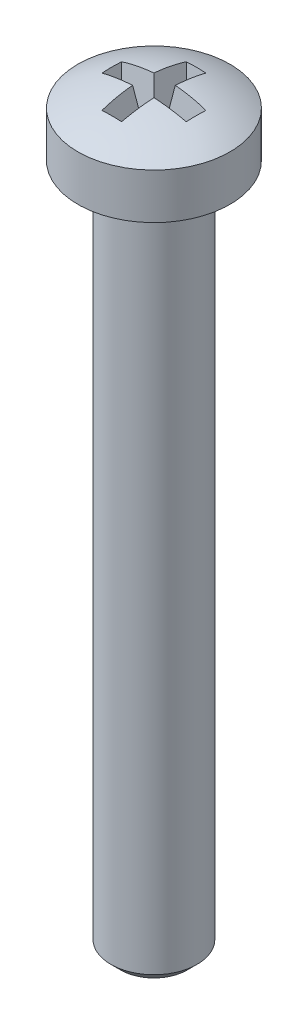
ISO-10303-21;
HEADER;
FILE_DESCRIPTION(('STEP AP214'),'2;1');
FILE_NAME('part.step','',(''),(''),'','','');
FILE_SCHEMA(('AUTOMOTIVE_DESIGN { 1 0 10303 214 1 1 1 1 }'));
ENDSEC;
DATA;
#1=APPLICATION_CONTEXT('core data for automotive mechanical design processes');
#2=APPLICATION_PROTOCOL_DEFINITION('international standard','automotive_design',2000,#1);
#3=PRODUCT_CONTEXT('',#1,'mechanical');
#4=PRODUCT('Part','Part','',(#3));
#5=PRODUCT_RELATED_PRODUCT_CATEGORY('part','',(#4));
#6=PRODUCT_DEFINITION_FORMATION('','',#4);
#7=PRODUCT_DEFINITION_CONTEXT('part definition',#1,'design');
#8=PRODUCT_DEFINITION('design','',#6,#7);
#9=PRODUCT_DEFINITION_SHAPE('','',#8);
#10=(LENGTH_UNIT() NAMED_UNIT(*) SI_UNIT(.MILLI.,.METRE.));
#11=(NAMED_UNIT(*) PLANE_ANGLE_UNIT() SI_UNIT($,.RADIAN.));
#12=(NAMED_UNIT(*) SI_UNIT($,.STERADIAN.) SOLID_ANGLE_UNIT());
#13=UNCERTAINTY_MEASURE_WITH_UNIT(LENGTH_MEASURE(1.E-05),#10,'distance_accuracy_value','');
#14=(GEOMETRIC_REPRESENTATION_CONTEXT(3) GLOBAL_UNCERTAINTY_ASSIGNED_CONTEXT((#13)) GLOBAL_UNIT_ASSIGNED_CONTEXT((#10,
#11,#12)) REPRESENTATION_CONTEXT('',''));
#15=CARTESIAN_POINT('',(0.,0.,0.));
#16=DIRECTION('',(0.,0.,1.));
#17=DIRECTION('',(1.,0.,0.));
#18=AXIS2_PLACEMENT_3D('',#15,#16,#17);
#19=CARTESIAN_POINT('',(6.,9.8,3.3));
#20=DIRECTION('',(0.,1.,0.));
#21=DIRECTION('',(0.,0.,1.));
#22=AXIS2_PLACEMENT_3D('',#19,#20,#21);
#23=SPHERICAL_SURFACE('',#22,3.);
#24=CARTESIAN_POINT('',(6.,12.3980762113533,3.3));
#25=DIRECTION('',(0.,1.,0.));
#26=DIRECTION('',(-1.,0.,0.));
#27=AXIS2_PLACEMENT_3D('',#24,#25,#26);
#28=CIRCLE('',#27,1.5);
#29=CARTESIAN_POINT('',(4.5,12.3980762113533,3.3));
#30=VERTEX_POINT('',#29);
#31=EDGE_CURVE('E161',#30,#30,#28,.T.);
#32=ORIENTED_EDGE('',*,*,#31,.T.);
#33=EDGE_LOOP('',(#32));
#34=FACE_BOUND('',#33,.T.);
#35=CARTESIAN_POINT('',(6.,9.74139917848052,2.91226230211363));
#36=DIRECTION('',(0.,-0.149438132473599,-0.988771077936042));
#37=DIRECTION('',(0.,0.988771077936042,-0.149438132473599));
#38=AXIS2_PLACEMENT_3D('',#35,#36,#37);
#39=CIRCLE('',#38,2.97426048310416);
#40=CARTESIAN_POINT('',(6.19376146307784,12.6760147557736,2.46873853692217));
#41=VERTEX_POINT('',#40);
#42=CARTESIAN_POINT('',(5.80623853692217,12.6760147557736,2.46873853692217));
#43=VERTEX_POINT('',#42);
#44=EDGE_CURVE('E11',#41,#43,#39,.F.);
#45=ORIENTED_EDGE('',*,*,#44,.F.);
#46=CARTESIAN_POINT('',(5.76447419197759,9.83559624435383,3.3));
#47=DIRECTION('',(0.988771077936042,-0.149438132473599,0.));
#48=DIRECTION('',(0.149438132473599,0.988771077936042,0.));
#49=AXIS2_PLACEMENT_3D('',#46,#47,#48);
#50=CIRCLE('',#49,2.99052846519529);
#51=CARTESIAN_POINT('',(6.21026715799329,12.7852261965451,3.08973284200672));
#52=VERTEX_POINT('',#51);
#53=EDGE_CURVE('E25',#52,#41,#50,.F.);
#54=ORIENTED_EDGE('',*,*,#53,.F.);
#55=CARTESIAN_POINT('',(6.,9.83559624435383,3.53552580802242));
#56=DIRECTION('',(0.,-0.149438132473599,-0.988771077936042));
#57=DIRECTION('',(0.,0.988771077936042,-0.149438132473599));
#58=AXIS2_PLACEMENT_3D('',#55,#56,#57);
#59=CIRCLE('',#58,2.99052846519529);
#60=CARTESIAN_POINT('',(6.83126146307784,12.6760147557736,3.10623853692217));
#61=VERTEX_POINT('',#60);
#62=EDGE_CURVE('E213',#61,#52,#59,.F.);
#63=ORIENTED_EDGE('',*,*,#62,.F.);
#64=CARTESIAN_POINT('',(6.38773769788638,9.74139917848052,3.3));
#65=DIRECTION('',(0.988771077936042,-0.149438132473599,0.));
#66=DIRECTION('',(0.149438132473599,0.988771077936042,0.));
#67=AXIS2_PLACEMENT_3D('',#64,#65,#66);
#68=CIRCLE('',#67,2.97426048310416);
#69=CARTESIAN_POINT('',(6.83126146307784,12.6760147557736,3.49376146307783));
#70=VERTEX_POINT('',#69);
#71=EDGE_CURVE('E210',#70,#61,#68,.F.);
#72=ORIENTED_EDGE('',*,*,#71,.F.);
#73=CARTESIAN_POINT('',(6.,9.83559624435383,3.06447419197759));
#74=DIRECTION('',(0.,-0.149438132473599,0.988771077936042));
#75=DIRECTION('',(0.,-0.988771077936042,-0.149438132473599));
#76=AXIS2_PLACEMENT_3D('',#73,#74,#75);
#77=CIRCLE('',#76,2.99052846519529);
#78=CARTESIAN_POINT('',(6.21026715799329,12.7852261965451,3.51026715799328));
#79=VERTEX_POINT('',#78);
#80=EDGE_CURVE('E207',#79,#70,#77,.F.);
#81=ORIENTED_EDGE('',*,*,#80,.F.);
#82=CARTESIAN_POINT('',(5.76447419197759,9.83559624435383,3.3));
#83=DIRECTION('',(0.988771077936042,-0.149438132473599,0.));
#84=DIRECTION('',(0.149438132473599,0.988771077936042,0.));
#85=AXIS2_PLACEMENT_3D('',#82,#83,#84);
#86=CIRCLE('',#85,2.99052846519529);
#87=CARTESIAN_POINT('',(6.19376146307784,12.6760147557736,4.13126146307783));
#88=VERTEX_POINT('',#87);
#89=EDGE_CURVE('E204',#88,#79,#86,.F.);
#90=ORIENTED_EDGE('',*,*,#89,.F.);
#91=CARTESIAN_POINT('',(6.,9.74139917848052,3.68773769788637));
#92=DIRECTION('',(0.,-0.149438132473599,0.988771077936042));
#93=DIRECTION('',(0.,-0.988771077936042,-0.149438132473599));
#94=AXIS2_PLACEMENT_3D('',#91,#92,#93);
#95=CIRCLE('',#94,2.97426048310416);
#96=CARTESIAN_POINT('',(5.80623853692217,12.6760147557736,4.13126146307783));
#97=VERTEX_POINT('',#96);
#98=EDGE_CURVE('E201',#97,#88,#95,.F.);
#99=ORIENTED_EDGE('',*,*,#98,.F.);
#100=CARTESIAN_POINT('',(6.23552580802241,9.83559624435383,3.3));
#101=DIRECTION('',(-0.988771077936042,-0.149438132473599,0.));
#102=DIRECTION('',(0.149438132473599,-0.988771077936042,0.));
#103=AXIS2_PLACEMENT_3D('',#100,#101,#102);
#104=CIRCLE('',#103,2.99052846519529);
#105=CARTESIAN_POINT('',(5.78973284200671,12.7852261965451,3.51026715799328));
#106=VERTEX_POINT('',#105);
#107=EDGE_CURVE('E198',#106,#97,#104,.F.);
#108=ORIENTED_EDGE('',*,*,#107,.F.);
#109=CARTESIAN_POINT('',(6.,9.83559624435383,3.06447419197759));
#110=DIRECTION('',(0.,-0.149438132473599,0.988771077936042));
#111=DIRECTION('',(0.,-0.988771077936042,-0.149438132473599));
#112=AXIS2_PLACEMENT_3D('',#109,#110,#111);
#113=CIRCLE('',#112,2.99052846519529);
#114=CARTESIAN_POINT('',(5.16873853692217,12.6760147557736,3.49376146307783));
#115=VERTEX_POINT('',#114);
#116=EDGE_CURVE('E195',#115,#106,#113,.F.);
#117=ORIENTED_EDGE('',*,*,#116,.F.);
#118=CARTESIAN_POINT('',(5.61226230211363,9.74139917848052,3.3));
#119=DIRECTION('',(-0.988771077936042,-0.149438132473599,0.));
#120=DIRECTION('',(0.149438132473599,-0.988771077936042,0.));
#121=AXIS2_PLACEMENT_3D('',#118,#119,#120);
#122=CIRCLE('',#121,2.97426048310416);
#123=CARTESIAN_POINT('',(5.16873853692217,12.6760147557736,3.10623853692217));
#124=VERTEX_POINT('',#123);
#125=EDGE_CURVE('E192',#124,#115,#122,.F.);
#126=ORIENTED_EDGE('',*,*,#125,.F.);
#127=CARTESIAN_POINT('',(6.,9.83559624435383,3.53552580802242));
#128=DIRECTION('',(0.,-0.149438132473599,-0.988771077936042));
#129=DIRECTION('',(0.,0.988771077936042,-0.149438132473599));
#130=AXIS2_PLACEMENT_3D('',#127,#128,#129);
#131=CIRCLE('',#130,2.99052846519529);
#132=CARTESIAN_POINT('',(5.78973284200671,12.7852261965451,3.08973284200672));
#133=VERTEX_POINT('',#132);
#134=EDGE_CURVE('E189',#133,#124,#131,.F.);
#135=ORIENTED_EDGE('',*,*,#134,.F.);
#136=CARTESIAN_POINT('',(6.23552580802242,9.83559624435383,3.3));
#137=DIRECTION('',(-0.988771077936042,-0.149438132473599,0.));
#138=DIRECTION('',(0.149438132473599,-0.988771077936042,0.));
#139=AXIS2_PLACEMENT_3D('',#136,#137,#138);
#140=CIRCLE('',#139,2.99052846519529);
#141=EDGE_CURVE('E186',#43,#133,#140,.F.);
#142=ORIENTED_EDGE('',*,*,#141,.F.);
#143=EDGE_LOOP('',(#45,#54,#63,#72,#81,#90,#99,#108,#117,#126,#135,#142));
#144=FACE_BOUND('',#143,.T.);
#145=ADVANCED_FACE('F16',(#34,#144),#23,.T.);
#146=CARTESIAN_POINT('',(6.,-2.,3.3));
#147=DIRECTION('',(0.,1.,0.));
#148=DIRECTION('',(-1.,0.,0.));
#149=AXIS2_PLACEMENT_3D('',#146,#147,#148);
#150=PLANE('',#149);
#151=CARTESIAN_POINT('',(6.,-2.,3.3));
#152=DIRECTION('',(0.,1.,0.));
#153=DIRECTION('',(-1.,0.,0.));
#154=AXIS2_PLACEMENT_3D('',#151,#152,#153);
#155=CIRCLE('',#154,0.6605625);
#156=CARTESIAN_POINT('',(5.3394375,-2.,3.3));
#157=VERTEX_POINT('',#156);
#158=EDGE_CURVE('E182',#157,#157,#155,.T.);
#159=ORIENTED_EDGE('',*,*,#158,.F.);
#160=EDGE_LOOP('',(#159));
#161=FACE_BOUND('',#160,.T.);
#162=ADVANCED_FACE('F18',(#161),#150,.F.);
#163=CARTESIAN_POINT('',(6.,-2.,3.3));
#164=DIRECTION('',(0.,1.,0.));
#165=DIRECTION('',(-1.,0.,0.));
#166=AXIS2_PLACEMENT_3D('',#163,#164,#165);
#167=CONICAL_SURFACE('',#166,0.6605625,0.785398163397448);
#168=CARTESIAN_POINT('',(6.,-1.8105625,3.3));
#169=DIRECTION('',(0.,1.,0.));
#170=DIRECTION('',(-1.,0.,0.));
#171=AXIS2_PLACEMENT_3D('',#168,#169,#170);
#172=CIRCLE('',#171,0.85);
#173=CARTESIAN_POINT('',(5.15,-1.8105625,3.3));
#174=VERTEX_POINT('',#173);
#175=EDGE_CURVE('E178',#174,#174,#172,.T.);
#176=ORIENTED_EDGE('',*,*,#175,.F.);
#177=EDGE_LOOP('',(#176));
#178=FACE_BOUND('',#177,.T.);
#179=ORIENTED_EDGE('',*,*,#158,.T.);
#180=EDGE_LOOP('',(#179));
#181=FACE_BOUND('',#180,.T.);
#182=ADVANCED_FACE('F397',(#178,#181),#167,.T.);
#183=CARTESIAN_POINT('',(6.,12.8,3.3));
#184=DIRECTION('',(0.,1.,0.));
#185=DIRECTION('',(-1.,0.,0.));
#186=AXIS2_PLACEMENT_3D('',#183,#184,#185);
#187=CYLINDRICAL_SURFACE('',#186,0.85);
#188=CARTESIAN_POINT('',(6.,11.4,3.3));
#189=DIRECTION('',(0.,1.,0.));
#190=DIRECTION('',(-1.,0.,0.));
#191=AXIS2_PLACEMENT_3D('',#188,#189,#190);
#192=CIRCLE('',#191,0.85);
#193=CARTESIAN_POINT('',(5.15,11.4,3.3));
#194=VERTEX_POINT('',#193);
#195=EDGE_CURVE('E174',#194,#194,#192,.T.);
#196=ORIENTED_EDGE('',*,*,#195,.F.);
#197=EDGE_LOOP('',(#196));
#198=FACE_BOUND('',#197,.T.);
#199=ORIENTED_EDGE('',*,*,#175,.T.);
#200=EDGE_LOOP('',(#199));
#201=FACE_BOUND('',#200,.T.);
#202=ADVANCED_FACE('F387',(#198,#201),#187,.T.);
#203=CARTESIAN_POINT('',(6.,11.4,3.3));
#204=DIRECTION('',(0.,1.,0.));
#205=DIRECTION('',(-1.,0.,0.));
#206=AXIS2_PLACEMENT_3D('',#203,#204,#205);
#207=TOROIDAL_SURFACE('',#206,0.95,0.1);
#208=ORIENTED_EDGE('',*,*,#195,.T.);
#209=EDGE_LOOP('',(#208));
#210=FACE_BOUND('',#209,.T.);
#211=CARTESIAN_POINT('',(6.,11.5,3.3));
#212=DIRECTION('',(0.,1.,0.));
#213=DIRECTION('',(-1.,0.,0.));
#214=AXIS2_PLACEMENT_3D('',#211,#212,#213);
#215=CIRCLE('',#214,0.95);
#216=CARTESIAN_POINT('',(5.05,11.5,3.3));
#217=VERTEX_POINT('',#216);
#218=EDGE_CURVE('E170',#217,#217,#215,.T.);
#219=ORIENTED_EDGE('',*,*,#218,.F.);
#220=EDGE_LOOP('',(#219));
#221=FACE_BOUND('',#220,.T.);
#222=ADVANCED_FACE('F377',(#210,#221),#207,.F.);
#223=CARTESIAN_POINT('',(6.,11.5,4.25));
#224=DIRECTION('',(0.,1.,0.));
#225=DIRECTION('',(-1.,0.,0.));
#226=AXIS2_PLACEMENT_3D('',#223,#224,#225);
#227=PLANE('',#226);
#228=CARTESIAN_POINT('',(6.,11.5,3.3));
#229=DIRECTION('',(0.,1.,0.));
#230=DIRECTION('',(-1.,0.,0.));
#231=AXIS2_PLACEMENT_3D('',#228,#229,#230);
#232=CIRCLE('',#231,1.5);
#233=CARTESIAN_POINT('',(4.5,11.5,3.3));
#234=VERTEX_POINT('',#233);
#235=EDGE_CURVE('E165',#234,#234,#232,.T.);
#236=ORIENTED_EDGE('',*,*,#235,.F.);
#237=EDGE_LOOP('',(#236));
#238=FACE_BOUND('',#237,.T.);
#239=ORIENTED_EDGE('',*,*,#218,.T.);
#240=EDGE_LOOP('',(#239));
#241=FACE_BOUND('',#240,.T.);
#242=ADVANCED_FACE('F367',(#238,#241),#227,.F.);
#243=CARTESIAN_POINT('',(6.,12.8,3.3));
#244=DIRECTION('',(0.,1.,0.));
#245=DIRECTION('',(-1.,0.,0.));
#246=AXIS2_PLACEMENT_3D('',#243,#244,#245);
#247=CYLINDRICAL_SURFACE('',#246,1.5);
#248=ORIENTED_EDGE('',*,*,#31,.F.);
#249=EDGE_LOOP('',(#248));
#250=FACE_BOUND('',#249,.T.);
#251=ORIENTED_EDGE('',*,*,#235,.T.);
#252=EDGE_LOOP('',(#251));
#253=FACE_BOUND('',#252,.T.);
#254=ADVANCED_FACE('F358',(#250,#253),#247,.T.);
#255=CARTESIAN_POINT('',(5.7875,12.8,2.45));
#256=DIRECTION('',(0.,-0.149438132473599,-0.988771077936042));
#257=DIRECTION('',(0.,0.988771077936042,-0.149438132473599));
#258=AXIS2_PLACEMENT_3D('',#255,#256,#257);
#259=PLANE('',#258);
#260=ORIENTED_EDGE('',*,*,#44,.T.);
#261=DIRECTION('',(-0.14779696163853,0.977912120929502,-0.14779696163853));
#262=VECTOR('',#261,1.);
#263=CARTESIAN_POINT('',(5.7875,12.8,2.45));
#264=LINE('',#263,#262);
#265=CARTESIAN_POINT('',(5.98397578347579,11.5,2.64647578347579));
#266=VERTEX_POINT('',#265);
#267=EDGE_CURVE('E32',#266,#43,#264,.T.);
#268=ORIENTED_EDGE('',*,*,#267,.F.);
#269=DIRECTION('',(-1.,0.,0.));
#270=VECTOR('',#269,1.);
#271=CARTESIAN_POINT('',(5.7875,11.5,2.64647578347579));
#272=LINE('',#271,#270);
#273=CARTESIAN_POINT('',(6.01602421652422,11.5,2.64647578347579));
#274=VERTEX_POINT('',#273);
#275=EDGE_CURVE('E118',#266,#274,#272,.F.);
#276=ORIENTED_EDGE('',*,*,#275,.T.);
#277=DIRECTION('',(0.14779696163853,0.977912120929502,-0.14779696163853));
#278=VECTOR('',#277,1.);
#279=CARTESIAN_POINT('',(6.2125,12.8,2.45));
#280=LINE('',#279,#278);
#281=EDGE_CURVE('E166',#274,#41,#280,.T.);
#282=ORIENTED_EDGE('',*,*,#281,.T.);
#283=EDGE_LOOP('',(#260,#268,#276,#282));
#284=FACE_BOUND('',#283,.T.);
#285=ADVANCED_FACE('F117',(#284),#259,.F.);
#286=CARTESIAN_POINT('',(6.2125,12.8,2.45));
#287=DIRECTION('',(0.988771077936042,-0.149438132473599,0.));
#288=DIRECTION('',(0.149438132473599,0.988771077936042,0.));
#289=AXIS2_PLACEMENT_3D('',#286,#287,#288);
#290=PLANE('',#289);
#291=ORIENTED_EDGE('',*,*,#53,.T.);
#292=ORIENTED_EDGE('',*,*,#281,.F.);
#293=DIRECTION('',(0.,0.,-1.));
#294=VECTOR('',#293,1.);
#295=CARTESIAN_POINT('',(6.01602421652422,11.5,2.45));
#296=LINE('',#295,#294);
#297=CARTESIAN_POINT('',(6.01602421652422,11.5,3.28397578347579));
#298=VERTEX_POINT('',#297);
#299=EDGE_CURVE('E125',#274,#298,#296,.F.);
#300=ORIENTED_EDGE('',*,*,#299,.T.);
#301=DIRECTION('',(0.14779696163853,0.977912120929502,-0.14779696163853));
#302=VECTOR('',#301,1.);
#303=CARTESIAN_POINT('',(6.22642551294186,12.8921394306421,3.07357448705815));
#304=LINE('',#303,#302);
#305=EDGE_CURVE('E516',#298,#52,#304,.T.);
#306=ORIENTED_EDGE('',*,*,#305,.T.);
#307=EDGE_LOOP('',(#291,#292,#300,#306));
#308=FACE_BOUND('',#307,.T.);
#309=ADVANCED_FACE('F340',(#308),#290,.F.);
#310=CARTESIAN_POINT('',(6.2125,12.8,3.0875));
#311=DIRECTION('',(0.,-0.149438132473599,-0.988771077936042));
#312=DIRECTION('',(0.,0.988771077936042,-0.149438132473599));
#313=AXIS2_PLACEMENT_3D('',#310,#311,#312);
#314=PLANE('',#313);
#315=ORIENTED_EDGE('',*,*,#62,.T.);
#316=ORIENTED_EDGE('',*,*,#305,.F.);
#317=DIRECTION('',(-1.,0.,0.));
#318=VECTOR('',#317,1.);
#319=CARTESIAN_POINT('',(6.2125,11.5,3.28397578347579));
#320=LINE('',#319,#318);
#321=CARTESIAN_POINT('',(6.65352421652422,11.5,3.28397578347579));
#322=VERTEX_POINT('',#321);
#323=EDGE_CURVE('E132',#298,#322,#320,.F.);
#324=ORIENTED_EDGE('',*,*,#323,.T.);
#325=DIRECTION('',(0.14779696163853,0.977912120929502,-0.14779696163853));
#326=VECTOR('',#325,1.);
#327=CARTESIAN_POINT('',(6.85,12.8,3.0875));
#328=LINE('',#327,#326);
#329=EDGE_CURVE('E512',#322,#61,#328,.T.);
#330=ORIENTED_EDGE('',*,*,#329,.T.);
#331=EDGE_LOOP('',(#315,#316,#324,#330));
#332=FACE_BOUND('',#331,.T.);
#333=ADVANCED_FACE('F330',(#332),#314,.F.);
#334=CARTESIAN_POINT('',(6.85,12.8,3.0875));
#335=DIRECTION('',(0.988771077936042,-0.149438132473599,0.));
#336=DIRECTION('',(0.149438132473599,0.988771077936042,0.));
#337=AXIS2_PLACEMENT_3D('',#334,#335,#336);
#338=PLANE('',#337);
#339=ORIENTED_EDGE('',*,*,#71,.T.);
#340=ORIENTED_EDGE('',*,*,#329,.F.);
#341=DIRECTION('',(0.,0.,-1.));
#342=VECTOR('',#341,1.);
#343=CARTESIAN_POINT('',(6.65352421652422,11.5,3.0875));
#344=LINE('',#343,#342);
#345=CARTESIAN_POINT('',(6.65352421652422,11.5,3.31602421652422));
#346=VERTEX_POINT('',#345);
#347=EDGE_CURVE('E138',#322,#346,#344,.F.);
#348=ORIENTED_EDGE('',*,*,#347,.T.);
#349=DIRECTION('',(0.14779696163853,0.977912120929502,0.14779696163853));
#350=VECTOR('',#349,1.);
#351=CARTESIAN_POINT('',(6.85,12.8,3.5125));
#352=LINE('',#351,#350);
#353=EDGE_CURVE('E508',#346,#70,#352,.T.);
#354=ORIENTED_EDGE('',*,*,#353,.T.);
#355=EDGE_LOOP('',(#339,#340,#348,#354));
#356=FACE_BOUND('',#355,.T.);
#357=ADVANCED_FACE('F320',(#356),#338,.F.);
#358=CARTESIAN_POINT('',(6.85,12.8,3.5125));
#359=DIRECTION('',(0.,-0.149438132473599,0.988771077936042));
#360=DIRECTION('',(0.,-0.988771077936042,-0.149438132473599));
#361=AXIS2_PLACEMENT_3D('',#358,#359,#360);
#362=PLANE('',#361);
#363=ORIENTED_EDGE('',*,*,#80,.T.);
#364=ORIENTED_EDGE('',*,*,#353,.F.);
#365=DIRECTION('',(1.,0.,0.));
#366=VECTOR('',#365,1.);
#367=CARTESIAN_POINT('',(6.85,11.5,3.31602421652422));
#368=LINE('',#367,#366);
#369=CARTESIAN_POINT('',(6.01602421652422,11.5,3.31602421652422));
#370=VERTEX_POINT('',#369);
#371=EDGE_CURVE('E141',#346,#370,#368,.F.);
#372=ORIENTED_EDGE('',*,*,#371,.T.);
#373=DIRECTION('',(0.14779696163853,0.977912120929502,0.14779696163853));
#374=VECTOR('',#373,1.);
#375=CARTESIAN_POINT('',(6.22642551294186,12.8921394306421,3.52642551294186));
#376=LINE('',#375,#374);
#377=EDGE_CURVE('E504',#370,#79,#376,.T.);
#378=ORIENTED_EDGE('',*,*,#377,.T.);
#379=EDGE_LOOP('',(#363,#364,#372,#378));
#380=FACE_BOUND('',#379,.T.);
#381=ADVANCED_FACE('F310',(#380),#362,.F.);
#382=CARTESIAN_POINT('',(6.2125,12.8,3.5125));
#383=DIRECTION('',(0.988771077936042,-0.149438132473599,0.));
#384=DIRECTION('',(0.149438132473599,0.988771077936042,0.));
#385=AXIS2_PLACEMENT_3D('',#382,#383,#384);
#386=PLANE('',#385);
#387=ORIENTED_EDGE('',*,*,#89,.T.);
#388=ORIENTED_EDGE('',*,*,#377,.F.);
#389=DIRECTION('',(0.,0.,-1.));
#390=VECTOR('',#389,1.);
#391=CARTESIAN_POINT('',(6.01602421652422,11.5,3.5125));
#392=LINE('',#391,#390);
#393=CARTESIAN_POINT('',(6.01602421652422,11.5,3.95352421652422));
#394=VERTEX_POINT('',#393);
#395=EDGE_CURVE('E144',#370,#394,#392,.F.);
#396=ORIENTED_EDGE('',*,*,#395,.T.);
#397=DIRECTION('',(0.14779696163853,0.977912120929502,0.14779696163853));
#398=VECTOR('',#397,1.);
#399=CARTESIAN_POINT('',(6.2125,12.8,4.15));
#400=LINE('',#399,#398);
#401=EDGE_CURVE('E500',#394,#88,#400,.T.);
#402=ORIENTED_EDGE('',*,*,#401,.T.);
#403=EDGE_LOOP('',(#387,#388,#396,#402));
#404=FACE_BOUND('',#403,.T.);
#405=ADVANCED_FACE('F300',(#404),#386,.F.);
#406=CARTESIAN_POINT('',(6.2125,12.8,4.15));
#407=DIRECTION('',(0.,-0.149438132473599,0.988771077936042));
#408=DIRECTION('',(0.,-0.988771077936042,-0.149438132473599));
#409=AXIS2_PLACEMENT_3D('',#406,#407,#408);
#410=PLANE('',#409);
#411=ORIENTED_EDGE('',*,*,#98,.T.);
#412=ORIENTED_EDGE('',*,*,#401,.F.);
#413=DIRECTION('',(1.,0.,0.));
#414=VECTOR('',#413,1.);
#415=CARTESIAN_POINT('',(6.2125,11.5,3.95352421652422));
#416=LINE('',#415,#414);
#417=CARTESIAN_POINT('',(5.98397578347579,11.5,3.95352421652422));
#418=VERTEX_POINT('',#417);
#419=EDGE_CURVE('E147',#394,#418,#416,.F.);
#420=ORIENTED_EDGE('',*,*,#419,.T.);
#421=DIRECTION('',(-0.14779696163853,0.977912120929502,0.14779696163853));
#422=VECTOR('',#421,1.);
#423=CARTESIAN_POINT('',(5.7875,12.8,4.15));
#424=LINE('',#423,#422);
#425=EDGE_CURVE('E496',#418,#97,#424,.T.);
#426=ORIENTED_EDGE('',*,*,#425,.T.);
#427=EDGE_LOOP('',(#411,#412,#420,#426));
#428=FACE_BOUND('',#427,.T.);
#429=ADVANCED_FACE('F290',(#428),#410,.F.);
#430=CARTESIAN_POINT('',(5.7875,12.8,4.15));
#431=DIRECTION('',(-0.988771077936042,-0.149438132473599,0.));
#432=DIRECTION('',(0.149438132473599,-0.988771077936042,0.));
#433=AXIS2_PLACEMENT_3D('',#430,#431,#432);
#434=PLANE('',#433);
#435=ORIENTED_EDGE('',*,*,#107,.T.);
#436=ORIENTED_EDGE('',*,*,#425,.F.);
#437=DIRECTION('',(0.,0.,1.));
#438=VECTOR('',#437,1.);
#439=CARTESIAN_POINT('',(5.98397578347579,11.5,4.15));
#440=LINE('',#439,#438);
#441=CARTESIAN_POINT('',(5.98397578347579,11.5,3.31602421652422));
#442=VERTEX_POINT('',#441);
#443=EDGE_CURVE('E150',#418,#442,#440,.F.);
#444=ORIENTED_EDGE('',*,*,#443,.T.);
#445=DIRECTION('',(-0.14779696163853,0.977912120929502,0.14779696163853));
#446=VECTOR('',#445,1.);
#447=CARTESIAN_POINT('',(5.77357448705814,12.8921394306421,3.52642551294186));
#448=LINE('',#447,#446);
#449=EDGE_CURVE('E492',#442,#106,#448,.T.);
#450=ORIENTED_EDGE('',*,*,#449,.T.);
#451=EDGE_LOOP('',(#435,#436,#444,#450));
#452=FACE_BOUND('',#451,.T.);
#453=ADVANCED_FACE('F280',(#452),#434,.F.);
#454=CARTESIAN_POINT('',(5.7875,12.8,3.5125));
#455=DIRECTION('',(0.,-0.149438132473599,0.988771077936042));
#456=DIRECTION('',(0.,-0.988771077936042,-0.149438132473599));
#457=AXIS2_PLACEMENT_3D('',#454,#455,#456);
#458=PLANE('',#457);
#459=ORIENTED_EDGE('',*,*,#116,.T.);
#460=ORIENTED_EDGE('',*,*,#449,.F.);
#461=DIRECTION('',(1.,0.,0.));
#462=VECTOR('',#461,1.);
#463=CARTESIAN_POINT('',(5.7875,11.5,3.31602421652422));
#464=LINE('',#463,#462);
#465=CARTESIAN_POINT('',(5.34647578347579,11.5,3.31602421652422));
#466=VERTEX_POINT('',#465);
#467=EDGE_CURVE('E153',#442,#466,#464,.F.);
#468=ORIENTED_EDGE('',*,*,#467,.T.);
#469=DIRECTION('',(-0.14779696163853,0.977912120929502,0.14779696163853));
#470=VECTOR('',#469,1.);
#471=CARTESIAN_POINT('',(5.15,12.8,3.5125));
#472=LINE('',#471,#470);
#473=EDGE_CURVE('E486',#466,#115,#472,.T.);
#474=ORIENTED_EDGE('',*,*,#473,.T.);
#475=EDGE_LOOP('',(#459,#460,#468,#474));
#476=FACE_BOUND('',#475,.T.);
#477=ADVANCED_FACE('F270',(#476),#458,.F.);
#478=CARTESIAN_POINT('',(5.15,12.8,3.5125));
#479=DIRECTION('',(-0.988771077936042,-0.149438132473599,0.));
#480=DIRECTION('',(0.149438132473599,-0.988771077936042,0.));
#481=AXIS2_PLACEMENT_3D('',#478,#479,#480);
#482=PLANE('',#481);
#483=ORIENTED_EDGE('',*,*,#125,.T.);
#484=ORIENTED_EDGE('',*,*,#473,.F.);
#485=DIRECTION('',(0.,0.,1.));
#486=VECTOR('',#485,1.);
#487=CARTESIAN_POINT('',(5.34647578347579,11.5,3.5125));
#488=LINE('',#487,#486);
#489=CARTESIAN_POINT('',(5.34647578347579,11.5,3.28397578347579));
#490=VERTEX_POINT('',#489);
#491=EDGE_CURVE('E156',#466,#490,#488,.F.);
#492=ORIENTED_EDGE('',*,*,#491,.T.);
#493=DIRECTION('',(-0.14779696163853,0.977912120929502,-0.14779696163853));
#494=VECTOR('',#493,1.);
#495=CARTESIAN_POINT('',(5.15,12.8,3.0875));
#496=LINE('',#495,#494);
#497=EDGE_CURVE('E482',#490,#124,#496,.T.);
#498=ORIENTED_EDGE('',*,*,#497,.T.);
#499=EDGE_LOOP('',(#483,#484,#492,#498));
#500=FACE_BOUND('',#499,.T.);
#501=ADVANCED_FACE('F260',(#500),#482,.F.);
#502=CARTESIAN_POINT('',(5.15,12.8,3.0875));
#503=DIRECTION('',(0.,-0.149438132473599,-0.988771077936042));
#504=DIRECTION('',(0.,0.988771077936042,-0.149438132473599));
#505=AXIS2_PLACEMENT_3D('',#502,#503,#504);
#506=PLANE('',#505);
#507=ORIENTED_EDGE('',*,*,#134,.T.);
#508=ORIENTED_EDGE('',*,*,#497,.F.);
#509=DIRECTION('',(-1.,0.,0.));
#510=VECTOR('',#509,1.);
#511=CARTESIAN_POINT('',(5.15,11.5,3.28397578347579));
#512=LINE('',#511,#510);
#513=CARTESIAN_POINT('',(5.98397578347579,11.5,3.28397578347579));
#514=VERTEX_POINT('',#513);
#515=EDGE_CURVE('E113',#490,#514,#512,.F.);
#516=ORIENTED_EDGE('',*,*,#515,.T.);
#517=DIRECTION('',(-0.14779696163853,0.977912120929502,-0.14779696163853));
#518=VECTOR('',#517,1.);
#519=CARTESIAN_POINT('',(5.77357448705814,12.8921394306421,3.07357448705815));
#520=LINE('',#519,#518);
#521=EDGE_CURVE('E108',#514,#133,#520,.T.);
#522=ORIENTED_EDGE('',*,*,#521,.T.);
#523=EDGE_LOOP('',(#507,#508,#516,#522));
#524=FACE_BOUND('',#523,.T.);
#525=ADVANCED_FACE('F251',(#524),#506,.F.);
#526=CARTESIAN_POINT('',(5.7875,12.8,3.0875));
#527=DIRECTION('',(-0.988771077936042,-0.149438132473599,0.));
#528=DIRECTION('',(0.149438132473599,-0.988771077936042,0.));
#529=AXIS2_PLACEMENT_3D('',#526,#527,#528);
#530=PLANE('',#529);
#531=ORIENTED_EDGE('',*,*,#141,.T.);
#532=ORIENTED_EDGE('',*,*,#521,.F.);
#533=DIRECTION('',(0.,0.,1.));
#534=VECTOR('',#533,1.);
#535=CARTESIAN_POINT('',(5.98397578347579,11.5,3.0875));
#536=LINE('',#535,#534);
#537=EDGE_CURVE('E105',#514,#266,#536,.F.);
#538=ORIENTED_EDGE('',*,*,#537,.T.);
#539=ORIENTED_EDGE('',*,*,#267,.T.);
#540=EDGE_LOOP('',(#531,#532,#538,#539));
#541=FACE_BOUND('',#540,.T.);
#542=ADVANCED_FACE('F106',(#541),#530,.F.);
#543=CARTESIAN_POINT('',(6.2125,11.5,2.45));
#544=DIRECTION('',(0.,-1.,0.));
#545=DIRECTION('',(1.,0.,0.));
#546=AXIS2_PLACEMENT_3D('',#543,#544,#545);
#547=PLANE('',#546);
#548=ORIENTED_EDGE('',*,*,#275,.F.);
#549=ORIENTED_EDGE('',*,*,#537,.F.);
#550=ORIENTED_EDGE('',*,*,#515,.F.);
#551=ORIENTED_EDGE('',*,*,#491,.F.);
#552=ORIENTED_EDGE('',*,*,#467,.F.);
#553=ORIENTED_EDGE('',*,*,#443,.F.);
#554=ORIENTED_EDGE('',*,*,#419,.F.);
#555=ORIENTED_EDGE('',*,*,#395,.F.);
#556=ORIENTED_EDGE('',*,*,#371,.F.);
#557=ORIENTED_EDGE('',*,*,#347,.F.);
#558=ORIENTED_EDGE('',*,*,#323,.F.);
#559=ORIENTED_EDGE('',*,*,#299,.F.);
#560=EDGE_LOOP('',(#548,#549,#550,#551,#552,#553,#554,#555,#556,#557,#558,#559));
#561=FACE_BOUND('',#560,.T.);
#562=ADVANCED_FACE('F123',(#561),#547,.F.);
#563=CLOSED_SHELL('',(#145,#162,#182,#202,#222,#242,#254,#285,#309,#333,#357,#381,#405,#429,
#453,#477,#501,#525,#542,#562));
#564=MANIFOLD_SOLID_BREP('B1',#563);
#565=ADVANCED_BREP_SHAPE_REPRESENTATION('',(#18,#564),#14);
#566=SHAPE_DEFINITION_REPRESENTATION(#9,#565);
ENDSEC;
END-ISO-10303-21;
